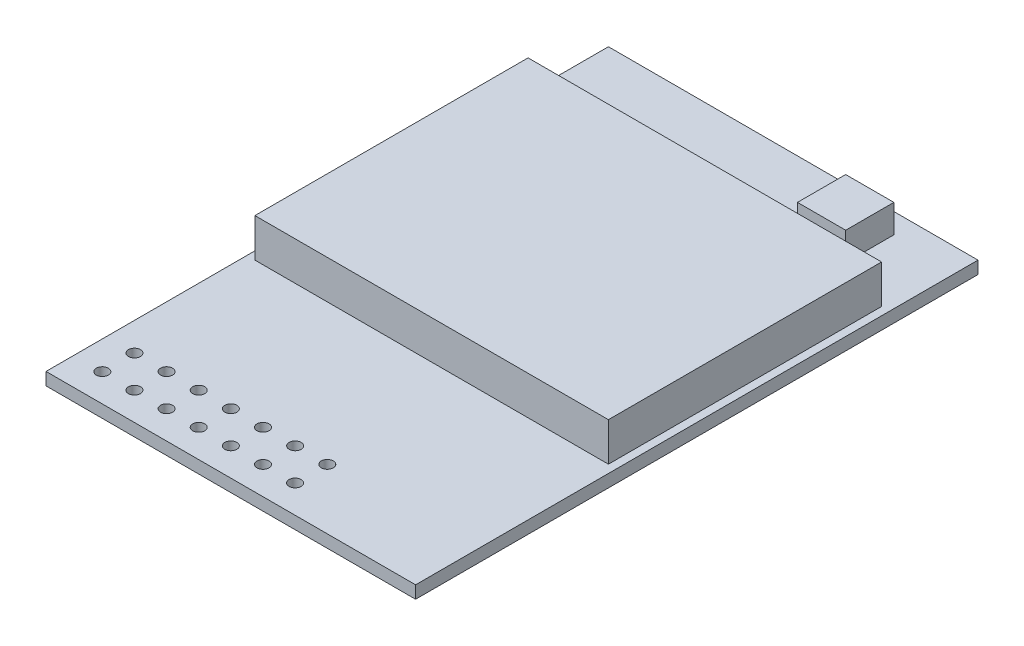
ISO-10303-21;
HEADER;
FILE_DESCRIPTION(('STEP AP214'),'2;1');
FILE_NAME('part.step','',(''),(''),'','','');
FILE_SCHEMA(('AUTOMOTIVE_DESIGN { 1 0 10303 214 1 1 1 1 }'));
ENDSEC;
DATA;
#1=APPLICATION_CONTEXT('core data for automotive mechanical design processes');
#2=APPLICATION_PROTOCOL_DEFINITION('international standard','automotive_design',2000,#1);
#3=PRODUCT_CONTEXT('',#1,'mechanical');
#4=PRODUCT('Part','Part','',(#3));
#5=PRODUCT_RELATED_PRODUCT_CATEGORY('part','',(#4));
#6=PRODUCT_DEFINITION_FORMATION('','',#4);
#7=PRODUCT_DEFINITION_CONTEXT('part definition',#1,'design');
#8=PRODUCT_DEFINITION('design','',#6,#7);
#9=PRODUCT_DEFINITION_SHAPE('','',#8);
#10=(LENGTH_UNIT() NAMED_UNIT(*) SI_UNIT(.MILLI.,.METRE.));
#11=(NAMED_UNIT(*) PLANE_ANGLE_UNIT() SI_UNIT($,.RADIAN.));
#12=(NAMED_UNIT(*) SI_UNIT($,.STERADIAN.) SOLID_ANGLE_UNIT());
#13=UNCERTAINTY_MEASURE_WITH_UNIT(LENGTH_MEASURE(1.E-05),#10,'distance_accuracy_value','');
#14=(GEOMETRIC_REPRESENTATION_CONTEXT(3) GLOBAL_UNCERTAINTY_ASSIGNED_CONTEXT((#13)) GLOBAL_UNIT_ASSIGNED_CONTEXT((#10,
#11,#12)) REPRESENTATION_CONTEXT('',''));
#15=CARTESIAN_POINT('',(0.,0.,0.));
#16=DIRECTION('',(0.,0.,1.));
#17=DIRECTION('',(1.,0.,0.));
#18=AXIS2_PLACEMENT_3D('',#15,#16,#17);
#19=CARTESIAN_POINT('',(0.,0.78,0.));
#20=DIRECTION('',(0.,-1.,0.));
#21=DIRECTION('',(0.,0.,-1.));
#22=AXIS2_PLACEMENT_3D('',#19,#20,#21);
#23=PLANE('',#22);
#24=CARTESIAN_POINT('',(-5.73693796657849,0.78,13.7591055458466));
#25=DIRECTION('',(0.,1.,0.));
#26=DIRECTION('',(0.,0.,1.));
#27=AXIS2_PLACEMENT_3D('',#24,#25,#26);
#28=CIRCLE('',#27,0.375000000000001);
#29=CARTESIAN_POINT('',(-5.73693796657849,0.78,14.1341055458466));
#30=VERTEX_POINT('',#29);
#31=EDGE_CURVE('E520',#30,#30,#28,.T.);
#32=ORIENTED_EDGE('',*,*,#31,.F.);
#33=EDGE_LOOP('',(#32));
#34=FACE_BOUND('',#33,.T.);
#35=CARTESIAN_POINT('',(-7.73693796657849,0.78,13.7591055458466));
#36=DIRECTION('',(0.,1.,0.));
#37=DIRECTION('',(0.,0.,1.));
#38=AXIS2_PLACEMENT_3D('',#35,#36,#37);
#39=CIRCLE('',#38,0.375000000000001);
#40=CARTESIAN_POINT('',(-7.73693796657849,0.78,14.1341055458466));
#41=VERTEX_POINT('',#40);
#42=EDGE_CURVE('E523',#41,#41,#39,.T.);
#43=ORIENTED_EDGE('',*,*,#42,.F.);
#44=EDGE_LOOP('',(#43));
#45=FACE_BOUND('',#44,.T.);
#46=CARTESIAN_POINT('',(2.26306203342152,0.78,15.7591055458466));
#47=DIRECTION('',(0.,1.,0.));
#48=DIRECTION('',(0.,0.,1.));
#49=AXIS2_PLACEMENT_3D('',#46,#47,#48);
#50=CIRCLE('',#49,0.375000000000001);
#51=CARTESIAN_POINT('',(2.26306203342152,0.78,16.1341055458466));
#52=VERTEX_POINT('',#51);
#53=EDGE_CURVE('E600',#52,#52,#50,.T.);
#54=ORIENTED_EDGE('',*,*,#53,.F.);
#55=EDGE_LOOP('',(#54));
#56=FACE_BOUND('',#55,.T.);
#57=CARTESIAN_POINT('',(0.263062033421519,0.78,15.7591055458466));
#58=DIRECTION('',(0.,1.,0.));
#59=DIRECTION('',(0.,0.,1.));
#60=AXIS2_PLACEMENT_3D('',#57,#58,#59);
#61=CIRCLE('',#60,0.375000000000001);
#62=CARTESIAN_POINT('',(0.263062033421519,0.78,16.1341055458466));
#63=VERTEX_POINT('',#62);
#64=EDGE_CURVE('E587',#63,#63,#61,.T.);
#65=ORIENTED_EDGE('',*,*,#64,.F.);
#66=EDGE_LOOP('',(#65));
#67=FACE_BOUND('',#66,.T.);
#68=CARTESIAN_POINT('',(-1.73693796657848,0.78,15.7591055458466));
#69=DIRECTION('',(0.,1.,0.));
#70=DIRECTION('',(0.,0.,1.));
#71=AXIS2_PLACEMENT_3D('',#68,#69,#70);
#72=CIRCLE('',#71,0.375000000000001);
#73=CARTESIAN_POINT('',(-1.73693796657848,0.78,16.1341055458466));
#74=VERTEX_POINT('',#73);
#75=EDGE_CURVE('E552',#74,#74,#72,.T.);
#76=ORIENTED_EDGE('',*,*,#75,.F.);
#77=EDGE_LOOP('',(#76));
#78=FACE_BOUND('',#77,.T.);
#79=CARTESIAN_POINT('',(-3.73693796657848,0.78,15.7591055458466));
#80=DIRECTION('',(0.,1.,0.));
#81=DIRECTION('',(0.,0.,1.));
#82=AXIS2_PLACEMENT_3D('',#79,#80,#81);
#83=CIRCLE('',#82,0.375000000000001);
#84=CARTESIAN_POINT('',(-3.73693796657848,0.78,16.1341055458466));
#85=VERTEX_POINT('',#84);
#86=EDGE_CURVE('E546',#85,#85,#83,.T.);
#87=ORIENTED_EDGE('',*,*,#86,.F.);
#88=EDGE_LOOP('',(#87));
#89=FACE_BOUND('',#88,.T.);
#90=CARTESIAN_POINT('',(-5.73693796657848,0.78,15.7591055458466));
#91=DIRECTION('',(0.,1.,0.));
#92=DIRECTION('',(0.,0.,1.));
#93=AXIS2_PLACEMENT_3D('',#90,#91,#92);
#94=CIRCLE('',#93,0.375000000000001);
#95=CARTESIAN_POINT('',(-5.73693796657848,0.78,16.1341055458466));
#96=VERTEX_POINT('',#95);
#97=EDGE_CURVE('E540',#96,#96,#94,.T.);
#98=ORIENTED_EDGE('',*,*,#97,.F.);
#99=EDGE_LOOP('',(#98));
#100=FACE_BOUND('',#99,.T.);
#101=CARTESIAN_POINT('',(-7.73693796657848,0.78,15.7591055458466));
#102=DIRECTION('',(0.,1.,0.));
#103=DIRECTION('',(0.,0.,1.));
#104=AXIS2_PLACEMENT_3D('',#101,#102,#103);
#105=CIRCLE('',#104,0.375000000000001);
#106=CARTESIAN_POINT('',(-7.73693796657848,0.78,16.1341055458466));
#107=VERTEX_POINT('',#106);
#108=EDGE_CURVE('E534',#107,#107,#105,.T.);
#109=ORIENTED_EDGE('',*,*,#108,.F.);
#110=EDGE_LOOP('',(#109));
#111=FACE_BOUND('',#110,.T.);
#112=CARTESIAN_POINT('',(-3.73693796657849,0.78,13.7591055458466));
#113=DIRECTION('',(0.,1.,0.));
#114=DIRECTION('',(0.,0.,1.));
#115=AXIS2_PLACEMENT_3D('',#112,#113,#114);
#116=CIRCLE('',#115,0.375000000000001);
#117=CARTESIAN_POINT('',(-3.73693796657849,0.78,14.1341055458466));
#118=VERTEX_POINT('',#117);
#119=EDGE_CURVE('E526',#118,#118,#116,.T.);
#120=ORIENTED_EDGE('',*,*,#119,.F.);
#121=EDGE_LOOP('',(#120));
#122=FACE_BOUND('',#121,.T.);
#123=CARTESIAN_POINT('',(-1.73693796657849,0.78,13.7591055458466));
#124=DIRECTION('',(0.,1.,0.));
#125=DIRECTION('',(0.,0.,1.));
#126=AXIS2_PLACEMENT_3D('',#123,#124,#125);
#127=CIRCLE('',#126,0.375000000000001);
#128=CARTESIAN_POINT('',(-1.73693796657849,0.78,14.1341055458466));
#129=VERTEX_POINT('',#128);
#130=EDGE_CURVE('E626',#129,#129,#127,.T.);
#131=ORIENTED_EDGE('',*,*,#130,.F.);
#132=EDGE_LOOP('',(#131));
#133=FACE_BOUND('',#132,.T.);
#134=CARTESIAN_POINT('',(0.263062033421512,0.78,13.7591055458466));
#135=DIRECTION('',(0.,1.,0.));
#136=DIRECTION('',(0.,0.,1.));
#137=AXIS2_PLACEMENT_3D('',#134,#135,#136);
#138=CIRCLE('',#137,0.375000000000001);
#139=CARTESIAN_POINT('',(0.263062033421512,0.78,14.1341055458466));
#140=VERTEX_POINT('',#139);
#141=EDGE_CURVE('E630',#140,#140,#138,.T.);
#142=ORIENTED_EDGE('',*,*,#141,.F.);
#143=EDGE_LOOP('',(#142));
#144=FACE_BOUND('',#143,.T.);
#145=CARTESIAN_POINT('',(2.26306203342151,0.78,13.7591055458466));
#146=DIRECTION('',(0.,1.,0.));
#147=DIRECTION('',(0.,0.,1.));
#148=AXIS2_PLACEMENT_3D('',#145,#146,#147);
#149=CIRCLE('',#148,0.375000000000001);
#150=CARTESIAN_POINT('',(2.26306203342151,0.78,14.1341055458466));
#151=VERTEX_POINT('',#150);
#152=EDGE_CURVE('E634',#151,#151,#149,.T.);
#153=ORIENTED_EDGE('',*,*,#152,.F.);
#154=EDGE_LOOP('',(#153));
#155=FACE_BOUND('',#154,.T.);
#156=CARTESIAN_POINT('',(-9.73693796657849,0.78,13.7591055458466));
#157=DIRECTION('',(0.,1.,0.));
#158=DIRECTION('',(0.,0.,1.));
#159=AXIS2_PLACEMENT_3D('',#156,#157,#158);
#160=CIRCLE('',#159,0.375000000000001);
#161=CARTESIAN_POINT('',(-9.73693796657849,0.78,14.1341055458466));
#162=VERTEX_POINT('',#161);
#163=EDGE_CURVE('E595',#162,#162,#160,.T.);
#164=ORIENTED_EDGE('',*,*,#163,.F.);
#165=EDGE_LOOP('',(#164));
#166=FACE_BOUND('',#165,.T.);
#167=CARTESIAN_POINT('',(-9.73693796657848,0.78,15.7591055458466));
#168=DIRECTION('',(0.,1.,0.));
#169=DIRECTION('',(0.,0.,1.));
#170=AXIS2_PLACEMENT_3D('',#167,#168,#169);
#171=CIRCLE('',#170,0.375000000000001);
#172=CARTESIAN_POINT('',(-9.73693796657848,0.78,16.1341055458466));
#173=VERTEX_POINT('',#172);
#174=EDGE_CURVE('E533',#173,#173,#171,.T.);
#175=ORIENTED_EDGE('',*,*,#174,.F.);
#176=EDGE_LOOP('',(#175));
#177=FACE_BOUND('',#176,.T.);
#178=DIRECTION('',(0.,0.,-1.));
#179=VECTOR('',#178,1.);
#180=CARTESIAN_POINT('',(11.,0.78,-12.));
#181=LINE('',#180,#179);
#182=CARTESIAN_POINT('',(11.,0.78,5.));
#183=VERTEX_POINT('',#182);
#184=CARTESIAN_POINT('',(11.,0.78,-12.));
#185=VERTEX_POINT('',#184);
#186=EDGE_CURVE('E149',#183,#185,#181,.T.);
#187=ORIENTED_EDGE('',*,*,#186,.F.);
#188=DIRECTION('',(1.,0.,0.));
#189=VECTOR('',#188,1.);
#190=CARTESIAN_POINT('',(-11.,0.78,5.));
#191=LINE('',#190,#189);
#192=CARTESIAN_POINT('',(-11.,0.78,5.));
#193=VERTEX_POINT('',#192);
#194=EDGE_CURVE('E162',#193,#183,#191,.T.);
#195=ORIENTED_EDGE('',*,*,#194,.F.);
#196=DIRECTION('',(0.,0.,1.));
#197=VECTOR('',#196,1.);
#198=CARTESIAN_POINT('',(-11.,0.78,-12.));
#199=LINE('',#198,#197);
#200=CARTESIAN_POINT('',(-11.,0.78,-12.));
#201=VERTEX_POINT('',#200);
#202=EDGE_CURVE('E171',#201,#193,#199,.T.);
#203=ORIENTED_EDGE('',*,*,#202,.F.);
#204=DIRECTION('',(-1.,0.,0.));
#205=VECTOR('',#204,1.);
#206=CARTESIAN_POINT('',(-11.,0.78,-12.));
#207=LINE('',#206,#205);
#208=EDGE_CURVE('E152',#185,#201,#207,.T.);
#209=ORIENTED_EDGE('',*,*,#208,.F.);
#210=EDGE_LOOP('',(#187,#195,#203,#209));
#211=FACE_BOUND('',#210,.T.);
#212=DIRECTION('',(0.,0.,-1.));
#213=VECTOR('',#212,1.);
#214=CARTESIAN_POINT('',(11.5,0.78,17.5));
#215=LINE('',#214,#213);
#216=CARTESIAN_POINT('',(11.5,0.78,17.5));
#217=VERTEX_POINT('',#216);
#218=CARTESIAN_POINT('',(11.5,0.78,-17.5));
#219=VERTEX_POINT('',#218);
#220=EDGE_CURVE('E188',#217,#219,#215,.T.);
#221=ORIENTED_EDGE('',*,*,#220,.T.);
#222=DIRECTION('',(-1.,0.,0.));
#223=VECTOR('',#222,1.);
#224=CARTESIAN_POINT('',(-11.5,0.78,-17.5));
#225=LINE('',#224,#223);
#226=CARTESIAN_POINT('',(-11.5,0.78,-17.5));
#227=VERTEX_POINT('',#226);
#228=EDGE_CURVE('E191',#219,#227,#225,.T.);
#229=ORIENTED_EDGE('',*,*,#228,.T.);
#230=DIRECTION('',(0.,0.,1.));
#231=VECTOR('',#230,1.);
#232=CARTESIAN_POINT('',(-11.5,0.78,17.5));
#233=LINE('',#232,#231);
#234=CARTESIAN_POINT('',(-11.5,0.78,17.5));
#235=VERTEX_POINT('',#234);
#236=EDGE_CURVE('E194',#227,#235,#233,.T.);
#237=ORIENTED_EDGE('',*,*,#236,.T.);
#238=DIRECTION('',(1.,0.,0.));
#239=VECTOR('',#238,1.);
#240=CARTESIAN_POINT('',(-11.5,0.78,17.5));
#241=LINE('',#240,#239);
#242=EDGE_CURVE('E196',#235,#217,#241,.T.);
#243=ORIENTED_EDGE('',*,*,#242,.T.);
#244=EDGE_LOOP('',(#221,#229,#237,#243));
#245=FACE_BOUND('',#244,.T.);
#246=DIRECTION('',(0.,0.,-1.));
#247=VECTOR('',#246,1.);
#248=CARTESIAN_POINT('',(7.52134132497843,0.78,-16.2441492984607));
#249=LINE('',#248,#247);
#250=CARTESIAN_POINT('',(7.52134132497843,0.78,-13.2441492984607));
#251=VERTEX_POINT('',#250);
#252=CARTESIAN_POINT('',(7.52134132497843,0.78,-16.2441492984607));
#253=VERTEX_POINT('',#252);
#254=EDGE_CURVE('E148',#251,#253,#249,.T.);
#255=ORIENTED_EDGE('',*,*,#254,.F.);
#256=DIRECTION('',(1.,0.,0.));
#257=VECTOR('',#256,1.);
#258=CARTESIAN_POINT('',(4.52134132497843,0.78,-13.2441492984607));
#259=LINE('',#258,#257);
#260=CARTESIAN_POINT('',(4.52134132497843,0.78,-13.2441492984607));
#261=VERTEX_POINT('',#260);
#262=EDGE_CURVE('E145',#261,#251,#259,.T.);
#263=ORIENTED_EDGE('',*,*,#262,.F.);
#264=DIRECTION('',(0.,0.,1.));
#265=VECTOR('',#264,1.);
#266=CARTESIAN_POINT('',(4.52134132497843,0.78,-16.2441492984607));
#267=LINE('',#266,#265);
#268=CARTESIAN_POINT('',(4.52134132497843,0.78,-16.2441492984607));
#269=VERTEX_POINT('',#268);
#270=EDGE_CURVE('E59',#269,#261,#267,.T.);
#271=ORIENTED_EDGE('',*,*,#270,.F.);
#272=DIRECTION('',(-1.,0.,0.));
#273=VECTOR('',#272,1.);
#274=CARTESIAN_POINT('',(4.52134132497843,0.78,-16.2441492984607));
#275=LINE('',#274,#273);
#276=EDGE_CURVE('E54',#253,#269,#275,.T.);
#277=ORIENTED_EDGE('',*,*,#276,.F.);
#278=EDGE_LOOP('',(#255,#263,#271,#277));
#279=FACE_BOUND('',#278,.T.);
#280=ADVANCED_FACE('F39',(#34,#45,#56,#67,#78,#89,#100,#111,#122,#133,#144,#155,#166,#177,#211,
#245,#279),#23,.F.);
#281=CARTESIAN_POINT('',(11.5,0.78,17.5));
#282=DIRECTION('',(-1.,0.,0.));
#283=DIRECTION('',(0.,0.,1.));
#284=AXIS2_PLACEMENT_3D('',#281,#282,#283);
#285=PLANE('',#284);
#286=DIRECTION('',(0.,0.,-1.));
#287=VECTOR('',#286,1.);
#288=CARTESIAN_POINT('',(11.5,0.,17.5));
#289=LINE('',#288,#287);
#290=CARTESIAN_POINT('',(11.5,0.,17.5));
#291=VERTEX_POINT('',#290);
#292=CARTESIAN_POINT('',(11.5,0.,-17.5));
#293=VERTEX_POINT('',#292);
#294=EDGE_CURVE('E187',#291,#293,#289,.T.);
#295=ORIENTED_EDGE('',*,*,#294,.T.);
#296=DIRECTION('',(0.,-1.,0.));
#297=VECTOR('',#296,1.);
#298=CARTESIAN_POINT('',(11.5,0.78,-17.5));
#299=LINE('',#298,#297);
#300=EDGE_CURVE('E11',#219,#293,#299,.T.);
#301=ORIENTED_EDGE('',*,*,#300,.F.);
#302=ORIENTED_EDGE('',*,*,#220,.F.);
#303=DIRECTION('',(0.,-1.,0.));
#304=VECTOR('',#303,1.);
#305=CARTESIAN_POINT('',(11.5,0.78,17.5));
#306=LINE('',#305,#304);
#307=EDGE_CURVE('E198',#217,#291,#306,.T.);
#308=ORIENTED_EDGE('',*,*,#307,.T.);
#309=EDGE_LOOP('',(#295,#301,#302,#308));
#310=FACE_BOUND('',#309,.T.);
#311=ADVANCED_FACE('F41',(#310),#285,.F.);
#312=CARTESIAN_POINT('',(-11.5,0.78,-17.5));
#313=DIRECTION('',(0.,0.,1.));
#314=DIRECTION('',(1.,0.,0.));
#315=AXIS2_PLACEMENT_3D('',#312,#313,#314);
#316=PLANE('',#315);
#317=DIRECTION('',(-1.,0.,0.));
#318=VECTOR('',#317,1.);
#319=CARTESIAN_POINT('',(-11.5,0.,-17.5));
#320=LINE('',#319,#318);
#321=CARTESIAN_POINT('',(-11.5,0.,-17.5));
#322=VERTEX_POINT('',#321);
#323=EDGE_CURVE('E201',#293,#322,#320,.T.);
#324=ORIENTED_EDGE('',*,*,#323,.T.);
#325=DIRECTION('',(0.,-1.,0.));
#326=VECTOR('',#325,1.);
#327=CARTESIAN_POINT('',(-11.5,0.78,-17.5));
#328=LINE('',#327,#326);
#329=EDGE_CURVE('E47',#227,#322,#328,.T.);
#330=ORIENTED_EDGE('',*,*,#329,.F.);
#331=ORIENTED_EDGE('',*,*,#228,.F.);
#332=ORIENTED_EDGE('',*,*,#300,.T.);
#333=EDGE_LOOP('',(#324,#330,#331,#332));
#334=FACE_BOUND('',#333,.T.);
#335=ADVANCED_FACE('F230',(#334),#316,.F.);
#336=CARTESIAN_POINT('',(-11.5,0.78,17.5));
#337=DIRECTION('',(1.,0.,0.));
#338=DIRECTION('',(0.,0.,-1.));
#339=AXIS2_PLACEMENT_3D('',#336,#337,#338);
#340=PLANE('',#339);
#341=DIRECTION('',(0.,0.,1.));
#342=VECTOR('',#341,1.);
#343=CARTESIAN_POINT('',(-11.5,0.,17.5));
#344=LINE('',#343,#342);
#345=CARTESIAN_POINT('',(-11.5,0.,17.5));
#346=VERTEX_POINT('',#345);
#347=EDGE_CURVE('E203',#322,#346,#344,.T.);
#348=ORIENTED_EDGE('',*,*,#347,.T.);
#349=DIRECTION('',(0.,-1.,0.));
#350=VECTOR('',#349,1.);
#351=CARTESIAN_POINT('',(-11.5,0.78,17.5));
#352=LINE('',#351,#350);
#353=EDGE_CURVE('E208',#235,#346,#352,.T.);
#354=ORIENTED_EDGE('',*,*,#353,.F.);
#355=ORIENTED_EDGE('',*,*,#236,.F.);
#356=ORIENTED_EDGE('',*,*,#329,.T.);
#357=EDGE_LOOP('',(#348,#354,#355,#356));
#358=FACE_BOUND('',#357,.T.);
#359=ADVANCED_FACE('F215',(#358),#340,.F.);
#360=CARTESIAN_POINT('',(-11.5,0.78,17.5));
#361=DIRECTION('',(0.,0.,-1.));
#362=DIRECTION('',(-1.,0.,0.));
#363=AXIS2_PLACEMENT_3D('',#360,#361,#362);
#364=PLANE('',#363);
#365=DIRECTION('',(1.,0.,0.));
#366=VECTOR('',#365,1.);
#367=CARTESIAN_POINT('',(-11.5,0.,17.5));
#368=LINE('',#367,#366);
#369=EDGE_CURVE('E192',#346,#291,#368,.T.);
#370=ORIENTED_EDGE('',*,*,#369,.T.);
#371=ORIENTED_EDGE('',*,*,#307,.F.);
#372=ORIENTED_EDGE('',*,*,#242,.F.);
#373=ORIENTED_EDGE('',*,*,#353,.T.);
#374=EDGE_LOOP('',(#370,#371,#372,#373));
#375=FACE_BOUND('',#374,.T.);
#376=ADVANCED_FACE('F224',(#375),#364,.F.);
#377=CARTESIAN_POINT('',(0.,0.,0.));
#378=DIRECTION('',(0.,-1.,0.));
#379=DIRECTION('',(0.,0.,-1.));
#380=AXIS2_PLACEMENT_3D('',#377,#378,#379);
#381=PLANE('',#380);
#382=CARTESIAN_POINT('',(-5.73693796657849,0.,13.7591055458466));
#383=DIRECTION('',(0.,1.,0.));
#384=DIRECTION('',(0.,0.,1.));
#385=AXIS2_PLACEMENT_3D('',#382,#383,#384);
#386=CIRCLE('',#385,0.375000000000001);
#387=CARTESIAN_POINT('',(-5.73693796657849,0.,14.1341055458466));
#388=VERTEX_POINT('',#387);
#389=EDGE_CURVE('E518',#388,#388,#386,.T.);
#390=ORIENTED_EDGE('',*,*,#389,.T.);
#391=EDGE_LOOP('',(#390));
#392=FACE_BOUND('',#391,.T.);
#393=CARTESIAN_POINT('',(-7.73693796657849,0.,13.7591055458466));
#394=DIRECTION('',(0.,1.,0.));
#395=DIRECTION('',(0.,0.,1.));
#396=AXIS2_PLACEMENT_3D('',#393,#394,#395);
#397=CIRCLE('',#396,0.375000000000001);
#398=CARTESIAN_POINT('',(-7.73693796657849,0.,14.1341055458466));
#399=VERTEX_POINT('',#398);
#400=EDGE_CURVE('E603',#399,#399,#397,.T.);
#401=ORIENTED_EDGE('',*,*,#400,.T.);
#402=EDGE_LOOP('',(#401));
#403=FACE_BOUND('',#402,.T.);
#404=CARTESIAN_POINT('',(2.26306203342152,0.,15.7591055458466));
#405=DIRECTION('',(0.,1.,0.));
#406=DIRECTION('',(0.,0.,1.));
#407=AXIS2_PLACEMENT_3D('',#404,#405,#406);
#408=CIRCLE('',#407,0.375000000000001);
#409=CARTESIAN_POINT('',(2.26306203342152,0.,16.1341055458466));
#410=VERTEX_POINT('',#409);
#411=EDGE_CURVE('E592',#410,#410,#408,.T.);
#412=ORIENTED_EDGE('',*,*,#411,.T.);
#413=EDGE_LOOP('',(#412));
#414=FACE_BOUND('',#413,.T.);
#415=CARTESIAN_POINT('',(0.263062033421519,0.,15.7591055458466));
#416=DIRECTION('',(0.,1.,0.));
#417=DIRECTION('',(0.,0.,1.));
#418=AXIS2_PLACEMENT_3D('',#415,#416,#417);
#419=CIRCLE('',#418,0.375000000000001);
#420=CARTESIAN_POINT('',(0.263062033421519,0.,16.1341055458466));
#421=VERTEX_POINT('',#420);
#422=EDGE_CURVE('E555',#421,#421,#419,.T.);
#423=ORIENTED_EDGE('',*,*,#422,.T.);
#424=EDGE_LOOP('',(#423));
#425=FACE_BOUND('',#424,.T.);
#426=CARTESIAN_POINT('',(-1.73693796657848,0.,15.7591055458466));
#427=DIRECTION('',(0.,1.,0.));
#428=DIRECTION('',(0.,0.,1.));
#429=AXIS2_PLACEMENT_3D('',#426,#427,#428);
#430=CIRCLE('',#429,0.375000000000001);
#431=CARTESIAN_POINT('',(-1.73693796657848,0.,16.1341055458466));
#432=VERTEX_POINT('',#431);
#433=EDGE_CURVE('E549',#432,#432,#430,.T.);
#434=ORIENTED_EDGE('',*,*,#433,.T.);
#435=EDGE_LOOP('',(#434));
#436=FACE_BOUND('',#435,.T.);
#437=CARTESIAN_POINT('',(-3.73693796657848,0.,15.7591055458466));
#438=DIRECTION('',(0.,1.,0.));
#439=DIRECTION('',(0.,0.,1.));
#440=AXIS2_PLACEMENT_3D('',#437,#438,#439);
#441=CIRCLE('',#440,0.375000000000001);
#442=CARTESIAN_POINT('',(-3.73693796657848,0.,16.1341055458466));
#443=VERTEX_POINT('',#442);
#444=EDGE_CURVE('E543',#443,#443,#441,.T.);
#445=ORIENTED_EDGE('',*,*,#444,.T.);
#446=EDGE_LOOP('',(#445));
#447=FACE_BOUND('',#446,.T.);
#448=CARTESIAN_POINT('',(-5.73693796657848,0.,15.7591055458466));
#449=DIRECTION('',(0.,1.,0.));
#450=DIRECTION('',(0.,0.,1.));
#451=AXIS2_PLACEMENT_3D('',#448,#449,#450);
#452=CIRCLE('',#451,0.375000000000001);
#453=CARTESIAN_POINT('',(-5.73693796657848,0.,16.1341055458466));
#454=VERTEX_POINT('',#453);
#455=EDGE_CURVE('E537',#454,#454,#452,.T.);
#456=ORIENTED_EDGE('',*,*,#455,.T.);
#457=EDGE_LOOP('',(#456));
#458=FACE_BOUND('',#457,.T.);
#459=CARTESIAN_POINT('',(-7.73693796657848,0.,15.7591055458466));
#460=DIRECTION('',(0.,1.,0.));
#461=DIRECTION('',(0.,0.,1.));
#462=AXIS2_PLACEMENT_3D('',#459,#460,#461);
#463=CIRCLE('',#462,0.375000000000001);
#464=CARTESIAN_POINT('',(-7.73693796657848,0.,16.1341055458466));
#465=VERTEX_POINT('',#464);
#466=EDGE_CURVE('E530',#465,#465,#463,.T.);
#467=ORIENTED_EDGE('',*,*,#466,.T.);
#468=EDGE_LOOP('',(#467));
#469=FACE_BOUND('',#468,.T.);
#470=CARTESIAN_POINT('',(-3.73693796657849,0.,13.7591055458466));
#471=DIRECTION('',(0.,1.,0.));
#472=DIRECTION('',(0.,0.,1.));
#473=AXIS2_PLACEMENT_3D('',#470,#471,#472);
#474=CIRCLE('',#473,0.375000000000001);
#475=CARTESIAN_POINT('',(-3.73693796657849,0.,14.1341055458466));
#476=VERTEX_POINT('',#475);
#477=EDGE_CURVE('E521',#476,#476,#474,.T.);
#478=ORIENTED_EDGE('',*,*,#477,.T.);
#479=EDGE_LOOP('',(#478));
#480=FACE_BOUND('',#479,.T.);
#481=CARTESIAN_POINT('',(-1.73693796657849,0.,13.7591055458466));
#482=DIRECTION('',(0.,1.,0.));
#483=DIRECTION('',(0.,0.,1.));
#484=AXIS2_PLACEMENT_3D('',#481,#482,#483);
#485=CIRCLE('',#484,0.375000000000001);
#486=CARTESIAN_POINT('',(-1.73693796657849,0.,14.1341055458466));
#487=VERTEX_POINT('',#486);
#488=EDGE_CURVE('E652',#487,#487,#485,.T.);
#489=ORIENTED_EDGE('',*,*,#488,.T.);
#490=EDGE_LOOP('',(#489));
#491=FACE_BOUND('',#490,.T.);
#492=CARTESIAN_POINT('',(0.263062033421512,0.,13.7591055458466));
#493=DIRECTION('',(0.,1.,0.));
#494=DIRECTION('',(0.,0.,1.));
#495=AXIS2_PLACEMENT_3D('',#492,#493,#494);
#496=CIRCLE('',#495,0.375000000000001);
#497=CARTESIAN_POINT('',(0.263062033421512,0.,14.1341055458466));
#498=VERTEX_POINT('',#497);
#499=EDGE_CURVE('E648',#498,#498,#496,.T.);
#500=ORIENTED_EDGE('',*,*,#499,.T.);
#501=EDGE_LOOP('',(#500));
#502=FACE_BOUND('',#501,.T.);
#503=CARTESIAN_POINT('',(2.26306203342151,0.,13.7591055458466));
#504=DIRECTION('',(0.,1.,0.));
#505=DIRECTION('',(0.,0.,1.));
#506=AXIS2_PLACEMENT_3D('',#503,#504,#505);
#507=CIRCLE('',#506,0.375000000000001);
#508=CARTESIAN_POINT('',(2.26306203342151,0.,14.1341055458466));
#509=VERTEX_POINT('',#508);
#510=EDGE_CURVE('E642',#509,#509,#507,.T.);
#511=ORIENTED_EDGE('',*,*,#510,.T.);
#512=EDGE_LOOP('',(#511));
#513=FACE_BOUND('',#512,.T.);
#514=CARTESIAN_POINT('',(-9.73693796657849,0.,13.7591055458466));
#515=DIRECTION('',(0.,1.,0.));
#516=DIRECTION('',(0.,0.,1.));
#517=AXIS2_PLACEMENT_3D('',#514,#515,#516);
#518=CIRCLE('',#517,0.375000000000001);
#519=CARTESIAN_POINT('',(-9.73693796657849,0.,14.1341055458466));
#520=VERTEX_POINT('',#519);
#521=EDGE_CURVE('E638',#520,#520,#518,.T.);
#522=ORIENTED_EDGE('',*,*,#521,.T.);
#523=EDGE_LOOP('',(#522));
#524=FACE_BOUND('',#523,.T.);
#525=CARTESIAN_POINT('',(-9.73693796657848,0.,15.7591055458466));
#526=DIRECTION('',(0.,1.,0.));
#527=DIRECTION('',(0.,0.,1.));
#528=AXIS2_PLACEMENT_3D('',#525,#526,#527);
#529=CIRCLE('',#528,0.375000000000001);
#530=CARTESIAN_POINT('',(-9.73693796657848,0.,16.1341055458466));
#531=VERTEX_POINT('',#530);
#532=EDGE_CURVE('E556',#531,#531,#529,.T.);
#533=ORIENTED_EDGE('',*,*,#532,.T.);
#534=EDGE_LOOP('',(#533));
#535=FACE_BOUND('',#534,.T.);
#536=ORIENTED_EDGE('',*,*,#294,.F.);
#537=ORIENTED_EDGE('',*,*,#369,.F.);
#538=ORIENTED_EDGE('',*,*,#347,.F.);
#539=ORIENTED_EDGE('',*,*,#323,.F.);
#540=EDGE_LOOP('',(#536,#537,#538,#539));
#541=FACE_BOUND('',#540,.T.);
#542=ADVANCED_FACE('F221',(#392,#403,#414,#425,#436,#447,#458,#469,#480,#491,#502,#513,#524,
#535,#541),#381,.T.);
#543=CARTESIAN_POINT('',(11.,3.18,-12.));
#544=DIRECTION('',(-1.,0.,0.));
#545=DIRECTION('',(0.,0.,1.));
#546=AXIS2_PLACEMENT_3D('',#543,#544,#545);
#547=PLANE('',#546);
#548=ORIENTED_EDGE('',*,*,#186,.T.);
#549=DIRECTION('',(0.,-1.,0.));
#550=VECTOR('',#549,1.);
#551=CARTESIAN_POINT('',(11.,3.18,-12.));
#552=LINE('',#551,#550);
#553=CARTESIAN_POINT('',(11.,3.18,-12.));
#554=VERTEX_POINT('',#553);
#555=EDGE_CURVE('E184',#554,#185,#552,.T.);
#556=ORIENTED_EDGE('',*,*,#555,.F.);
#557=DIRECTION('',(0.,0.,-1.));
#558=VECTOR('',#557,1.);
#559=CARTESIAN_POINT('',(11.,3.18,-12.));
#560=LINE('',#559,#558);
#561=CARTESIAN_POINT('',(11.,3.18,5.));
#562=VERTEX_POINT('',#561);
#563=EDGE_CURVE('E158',#562,#554,#560,.T.);
#564=ORIENTED_EDGE('',*,*,#563,.F.);
#565=DIRECTION('',(0.,-1.,0.));
#566=VECTOR('',#565,1.);
#567=CARTESIAN_POINT('',(11.,3.18,5.));
#568=LINE('',#567,#566);
#569=EDGE_CURVE('E167',#562,#183,#568,.T.);
#570=ORIENTED_EDGE('',*,*,#569,.T.);
#571=EDGE_LOOP('',(#548,#556,#564,#570));
#572=FACE_BOUND('',#571,.T.);
#573=ADVANCED_FACE('F246',(#572),#547,.F.);
#574=CARTESIAN_POINT('',(-11.,3.18,-12.));
#575=DIRECTION('',(0.,0.,1.));
#576=DIRECTION('',(1.,0.,0.));
#577=AXIS2_PLACEMENT_3D('',#574,#575,#576);
#578=PLANE('',#577);
#579=ORIENTED_EDGE('',*,*,#208,.T.);
#580=DIRECTION('',(0.,-1.,0.));
#581=VECTOR('',#580,1.);
#582=CARTESIAN_POINT('',(-11.,3.18,-12.));
#583=LINE('',#582,#581);
#584=CARTESIAN_POINT('',(-11.,3.18,-12.));
#585=VERTEX_POINT('',#584);
#586=EDGE_CURVE('E181',#585,#201,#583,.T.);
#587=ORIENTED_EDGE('',*,*,#586,.F.);
#588=DIRECTION('',(-1.,0.,0.));
#589=VECTOR('',#588,1.);
#590=CARTESIAN_POINT('',(-11.,3.18,-12.));
#591=LINE('',#590,#589);
#592=EDGE_CURVE('E161',#554,#585,#591,.T.);
#593=ORIENTED_EDGE('',*,*,#592,.F.);
#594=ORIENTED_EDGE('',*,*,#555,.T.);
#595=EDGE_LOOP('',(#579,#587,#593,#594));
#596=FACE_BOUND('',#595,.T.);
#597=ADVANCED_FACE('F267',(#596),#578,.F.);
#598=CARTESIAN_POINT('',(-11.,3.18,-12.));
#599=DIRECTION('',(1.,0.,0.));
#600=DIRECTION('',(0.,0.,-1.));
#601=AXIS2_PLACEMENT_3D('',#598,#599,#600);
#602=PLANE('',#601);
#603=ORIENTED_EDGE('',*,*,#202,.T.);
#604=DIRECTION('',(0.,-1.,0.));
#605=VECTOR('',#604,1.);
#606=CARTESIAN_POINT('',(-11.,3.18,5.));
#607=LINE('',#606,#605);
#608=CARTESIAN_POINT('',(-11.,3.18,5.));
#609=VERTEX_POINT('',#608);
#610=EDGE_CURVE('E178',#609,#193,#607,.T.);
#611=ORIENTED_EDGE('',*,*,#610,.F.);
#612=DIRECTION('',(0.,0.,1.));
#613=VECTOR('',#612,1.);
#614=CARTESIAN_POINT('',(-11.,3.18,-12.));
#615=LINE('',#614,#613);
#616=EDGE_CURVE('E164',#585,#609,#615,.T.);
#617=ORIENTED_EDGE('',*,*,#616,.F.);
#618=ORIENTED_EDGE('',*,*,#586,.T.);
#619=EDGE_LOOP('',(#603,#611,#617,#618));
#620=FACE_BOUND('',#619,.T.);
#621=ADVANCED_FACE('F274',(#620),#602,.F.);
#622=CARTESIAN_POINT('',(-11.,3.18,5.));
#623=DIRECTION('',(0.,0.,-1.));
#624=DIRECTION('',(-1.,0.,0.));
#625=AXIS2_PLACEMENT_3D('',#622,#623,#624);
#626=PLANE('',#625);
#627=ORIENTED_EDGE('',*,*,#194,.T.);
#628=ORIENTED_EDGE('',*,*,#569,.F.);
#629=DIRECTION('',(1.,0.,0.));
#630=VECTOR('',#629,1.);
#631=CARTESIAN_POINT('',(-11.,3.18,5.));
#632=LINE('',#631,#630);
#633=EDGE_CURVE('E166',#609,#562,#632,.T.);
#634=ORIENTED_EDGE('',*,*,#633,.F.);
#635=ORIENTED_EDGE('',*,*,#610,.T.);
#636=EDGE_LOOP('',(#627,#628,#634,#635));
#637=FACE_BOUND('',#636,.T.);
#638=ADVANCED_FACE('F281',(#637),#626,.F.);
#639=CARTESIAN_POINT('',(0.,3.18,0.));
#640=DIRECTION('',(0.,1.,0.));
#641=DIRECTION('',(0.,0.,1.));
#642=AXIS2_PLACEMENT_3D('',#639,#640,#641);
#643=PLANE('',#642);
#644=ORIENTED_EDGE('',*,*,#563,.T.);
#645=ORIENTED_EDGE('',*,*,#592,.T.);
#646=ORIENTED_EDGE('',*,*,#616,.T.);
#647=ORIENTED_EDGE('',*,*,#633,.T.);
#648=EDGE_LOOP('',(#644,#645,#646,#647));
#649=FACE_BOUND('',#648,.T.);
#650=ADVANCED_FACE('F289',(#649),#643,.T.);
#651=CARTESIAN_POINT('',(7.52134132497843,2.53,-16.2441492984607));
#652=DIRECTION('',(-1.,0.,0.));
#653=DIRECTION('',(0.,0.,1.));
#654=AXIS2_PLACEMENT_3D('',#651,#652,#653);
#655=PLANE('',#654);
#656=ORIENTED_EDGE('',*,*,#254,.T.);
#657=DIRECTION('',(0.,-1.,0.));
#658=VECTOR('',#657,1.);
#659=CARTESIAN_POINT('',(7.52134132497843,2.53,-16.2441492984607));
#660=LINE('',#659,#658);
#661=CARTESIAN_POINT('',(7.52134132497843,2.53,-16.2441492984607));
#662=VERTEX_POINT('',#661);
#663=EDGE_CURVE('E129',#662,#253,#660,.T.);
#664=ORIENTED_EDGE('',*,*,#663,.F.);
#665=DIRECTION('',(0.,0.,-1.));
#666=VECTOR('',#665,1.);
#667=CARTESIAN_POINT('',(7.52134132497843,2.53,-16.2441492984607));
#668=LINE('',#667,#666);
#669=CARTESIAN_POINT('',(7.52134132497843,2.53,-13.2441492984607));
#670=VERTEX_POINT('',#669);
#671=EDGE_CURVE('E136',#670,#662,#668,.T.);
#672=ORIENTED_EDGE('',*,*,#671,.F.);
#673=DIRECTION('',(0.,-1.,0.));
#674=VECTOR('',#673,1.);
#675=CARTESIAN_POINT('',(7.52134132497843,2.53,-13.2441492984607));
#676=LINE('',#675,#674);
#677=EDGE_CURVE('E563',#670,#251,#676,.T.);
#678=ORIENTED_EDGE('',*,*,#677,.T.);
#679=EDGE_LOOP('',(#656,#664,#672,#678));
#680=FACE_BOUND('',#679,.T.);
#681=ADVANCED_FACE('F147',(#680),#655,.F.);
#682=CARTESIAN_POINT('',(4.52134132497843,2.53,-16.2441492984607));
#683=DIRECTION('',(0.,0.,1.));
#684=DIRECTION('',(1.,0.,0.));
#685=AXIS2_PLACEMENT_3D('',#682,#683,#684);
#686=PLANE('',#685);
#687=ORIENTED_EDGE('',*,*,#276,.T.);
#688=DIRECTION('',(0.,-1.,0.));
#689=VECTOR('',#688,1.);
#690=CARTESIAN_POINT('',(4.52134132497843,2.53,-16.2441492984607));
#691=LINE('',#690,#689);
#692=CARTESIAN_POINT('',(4.52134132497843,2.53,-16.2441492984607));
#693=VERTEX_POINT('',#692);
#694=EDGE_CURVE('E132',#693,#269,#691,.T.);
#695=ORIENTED_EDGE('',*,*,#694,.F.);
#696=DIRECTION('',(-1.,0.,0.));
#697=VECTOR('',#696,1.);
#698=CARTESIAN_POINT('',(4.52134132497843,2.53,-16.2441492984607));
#699=LINE('',#698,#697);
#700=EDGE_CURVE('E125',#662,#693,#699,.T.);
#701=ORIENTED_EDGE('',*,*,#700,.F.);
#702=ORIENTED_EDGE('',*,*,#663,.T.);
#703=EDGE_LOOP('',(#687,#695,#701,#702));
#704=FACE_BOUND('',#703,.T.);
#705=ADVANCED_FACE('F127',(#704),#686,.F.);
#706=CARTESIAN_POINT('',(4.52134132497843,2.53,-16.2441492984607));
#707=DIRECTION('',(1.,0.,0.));
#708=DIRECTION('',(0.,0.,-1.));
#709=AXIS2_PLACEMENT_3D('',#706,#707,#708);
#710=PLANE('',#709);
#711=ORIENTED_EDGE('',*,*,#270,.T.);
#712=DIRECTION('',(0.,-1.,0.));
#713=VECTOR('',#712,1.);
#714=CARTESIAN_POINT('',(4.52134132497843,2.53,-13.2441492984607));
#715=LINE('',#714,#713);
#716=CARTESIAN_POINT('',(4.52134132497843,2.53,-13.2441492984607));
#717=VERTEX_POINT('',#716);
#718=EDGE_CURVE('E154',#717,#261,#715,.T.);
#719=ORIENTED_EDGE('',*,*,#718,.F.);
#720=DIRECTION('',(0.,0.,1.));
#721=VECTOR('',#720,1.);
#722=CARTESIAN_POINT('',(4.52134132497843,2.53,-16.2441492984607));
#723=LINE('',#722,#721);
#724=EDGE_CURVE('E135',#693,#717,#723,.T.);
#725=ORIENTED_EDGE('',*,*,#724,.F.);
#726=ORIENTED_EDGE('',*,*,#694,.T.);
#727=EDGE_LOOP('',(#711,#719,#725,#726));
#728=FACE_BOUND('',#727,.T.);
#729=ADVANCED_FACE('F310',(#728),#710,.F.);
#730=CARTESIAN_POINT('',(4.52134132497843,2.53,-13.2441492984607));
#731=DIRECTION('',(0.,0.,-1.));
#732=DIRECTION('',(-1.,0.,0.));
#733=AXIS2_PLACEMENT_3D('',#730,#731,#732);
#734=PLANE('',#733);
#735=ORIENTED_EDGE('',*,*,#262,.T.);
#736=ORIENTED_EDGE('',*,*,#677,.F.);
#737=DIRECTION('',(1.,0.,0.));
#738=VECTOR('',#737,1.);
#739=CARTESIAN_POINT('',(4.52134132497843,2.53,-13.2441492984607));
#740=LINE('',#739,#738);
#741=EDGE_CURVE('E141',#717,#670,#740,.T.);
#742=ORIENTED_EDGE('',*,*,#741,.F.);
#743=ORIENTED_EDGE('',*,*,#718,.T.);
#744=EDGE_LOOP('',(#735,#736,#742,#743));
#745=FACE_BOUND('',#744,.T.);
#746=ADVANCED_FACE('F317',(#745),#734,.F.);
#747=CARTESIAN_POINT('',(0.,2.53,0.));
#748=DIRECTION('',(0.,1.,0.));
#749=DIRECTION('',(0.,0.,1.));
#750=AXIS2_PLACEMENT_3D('',#747,#748,#749);
#751=PLANE('',#750);
#752=ORIENTED_EDGE('',*,*,#671,.T.);
#753=ORIENTED_EDGE('',*,*,#700,.T.);
#754=ORIENTED_EDGE('',*,*,#724,.T.);
#755=ORIENTED_EDGE('',*,*,#741,.T.);
#756=EDGE_LOOP('',(#752,#753,#754,#755));
#757=FACE_BOUND('',#756,.T.);
#758=ADVANCED_FACE('F139',(#757),#751,.T.);
#759=CARTESIAN_POINT('',(-9.73693796657848,0.,15.7591055458466));
#760=DIRECTION('',(0.,1.,0.));
#761=DIRECTION('',(0.,0.,1.));
#762=AXIS2_PLACEMENT_3D('',#759,#760,#761);
#763=CYLINDRICAL_SURFACE('',#762,0.375000000000001);
#764=ORIENTED_EDGE('',*,*,#532,.F.);
#765=EDGE_LOOP('',(#764));
#766=FACE_BOUND('',#765,.T.);
#767=ORIENTED_EDGE('',*,*,#174,.T.);
#768=EDGE_LOOP('',(#767));
#769=FACE_BOUND('',#768,.T.);
#770=ADVANCED_FACE('F332',(#766,#769),#763,.F.);
#771=CARTESIAN_POINT('',(-9.73693796657849,0.,13.7591055458466));
#772=DIRECTION('',(0.,1.,0.));
#773=DIRECTION('',(0.,0.,1.));
#774=AXIS2_PLACEMENT_3D('',#771,#772,#773);
#775=CYLINDRICAL_SURFACE('',#774,0.375000000000001);
#776=ORIENTED_EDGE('',*,*,#521,.F.);
#777=EDGE_LOOP('',(#776));
#778=FACE_BOUND('',#777,.T.);
#779=ORIENTED_EDGE('',*,*,#163,.T.);
#780=EDGE_LOOP('',(#779));
#781=FACE_BOUND('',#780,.T.);
#782=ADVANCED_FACE('F338',(#778,#781),#775,.F.);
#783=CARTESIAN_POINT('',(2.26306203342151,0.,13.7591055458466));
#784=DIRECTION('',(0.,1.,0.));
#785=DIRECTION('',(0.,0.,1.));
#786=AXIS2_PLACEMENT_3D('',#783,#784,#785);
#787=CYLINDRICAL_SURFACE('',#786,0.375000000000001);
#788=ORIENTED_EDGE('',*,*,#510,.F.);
#789=EDGE_LOOP('',(#788));
#790=FACE_BOUND('',#789,.T.);
#791=ORIENTED_EDGE('',*,*,#152,.T.);
#792=EDGE_LOOP('',(#791));
#793=FACE_BOUND('',#792,.T.);
#794=ADVANCED_FACE('F346',(#790,#793),#787,.F.);
#795=CARTESIAN_POINT('',(0.263062033421512,0.,13.7591055458466));
#796=DIRECTION('',(0.,1.,0.));
#797=DIRECTION('',(0.,0.,1.));
#798=AXIS2_PLACEMENT_3D('',#795,#796,#797);
#799=CYLINDRICAL_SURFACE('',#798,0.375000000000001);
#800=ORIENTED_EDGE('',*,*,#499,.F.);
#801=EDGE_LOOP('',(#800));
#802=FACE_BOUND('',#801,.T.);
#803=ORIENTED_EDGE('',*,*,#141,.T.);
#804=EDGE_LOOP('',(#803));
#805=FACE_BOUND('',#804,.T.);
#806=ADVANCED_FACE('F354',(#802,#805),#799,.F.);
#807=CARTESIAN_POINT('',(-1.73693796657849,0.,13.7591055458466));
#808=DIRECTION('',(0.,1.,0.));
#809=DIRECTION('',(0.,0.,1.));
#810=AXIS2_PLACEMENT_3D('',#807,#808,#809);
#811=CYLINDRICAL_SURFACE('',#810,0.375000000000001);
#812=ORIENTED_EDGE('',*,*,#488,.F.);
#813=EDGE_LOOP('',(#812));
#814=FACE_BOUND('',#813,.T.);
#815=ORIENTED_EDGE('',*,*,#130,.T.);
#816=EDGE_LOOP('',(#815));
#817=FACE_BOUND('',#816,.T.);
#818=ADVANCED_FACE('F362',(#814,#817),#811,.F.);
#819=CARTESIAN_POINT('',(-3.73693796657849,0.,13.7591055458466));
#820=DIRECTION('',(0.,1.,0.));
#821=DIRECTION('',(0.,0.,1.));
#822=AXIS2_PLACEMENT_3D('',#819,#820,#821);
#823=CYLINDRICAL_SURFACE('',#822,0.375000000000001);
#824=ORIENTED_EDGE('',*,*,#477,.F.);
#825=EDGE_LOOP('',(#824));
#826=FACE_BOUND('',#825,.T.);
#827=ORIENTED_EDGE('',*,*,#119,.T.);
#828=EDGE_LOOP('',(#827));
#829=FACE_BOUND('',#828,.T.);
#830=ADVANCED_FACE('F370',(#826,#829),#823,.F.);
#831=CARTESIAN_POINT('',(-7.73693796657848,0.,15.7591055458466));
#832=DIRECTION('',(0.,1.,0.));
#833=DIRECTION('',(0.,0.,1.));
#834=AXIS2_PLACEMENT_3D('',#831,#832,#833);
#835=CYLINDRICAL_SURFACE('',#834,0.375000000000001);
#836=ORIENTED_EDGE('',*,*,#466,.F.);
#837=EDGE_LOOP('',(#836));
#838=FACE_BOUND('',#837,.T.);
#839=ORIENTED_EDGE('',*,*,#108,.T.);
#840=EDGE_LOOP('',(#839));
#841=FACE_BOUND('',#840,.T.);
#842=ADVANCED_FACE('F378',(#838,#841),#835,.F.);
#843=CARTESIAN_POINT('',(-5.73693796657848,0.,15.7591055458466));
#844=DIRECTION('',(0.,1.,0.));
#845=DIRECTION('',(0.,0.,1.));
#846=AXIS2_PLACEMENT_3D('',#843,#844,#845);
#847=CYLINDRICAL_SURFACE('',#846,0.375000000000001);
#848=ORIENTED_EDGE('',*,*,#455,.F.);
#849=EDGE_LOOP('',(#848));
#850=FACE_BOUND('',#849,.T.);
#851=ORIENTED_EDGE('',*,*,#97,.T.);
#852=EDGE_LOOP('',(#851));
#853=FACE_BOUND('',#852,.T.);
#854=ADVANCED_FACE('F386',(#850,#853),#847,.F.);
#855=CARTESIAN_POINT('',(-3.73693796657848,0.,15.7591055458466));
#856=DIRECTION('',(0.,1.,0.));
#857=DIRECTION('',(0.,0.,1.));
#858=AXIS2_PLACEMENT_3D('',#855,#856,#857);
#859=CYLINDRICAL_SURFACE('',#858,0.375000000000001);
#860=ORIENTED_EDGE('',*,*,#444,.F.);
#861=EDGE_LOOP('',(#860));
#862=FACE_BOUND('',#861,.T.);
#863=ORIENTED_EDGE('',*,*,#86,.T.);
#864=EDGE_LOOP('',(#863));
#865=FACE_BOUND('',#864,.T.);
#866=ADVANCED_FACE('F394',(#862,#865),#859,.F.);
#867=CARTESIAN_POINT('',(-1.73693796657848,0.,15.7591055458466));
#868=DIRECTION('',(0.,1.,0.));
#869=DIRECTION('',(0.,0.,1.));
#870=AXIS2_PLACEMENT_3D('',#867,#868,#869);
#871=CYLINDRICAL_SURFACE('',#870,0.375000000000001);
#872=ORIENTED_EDGE('',*,*,#433,.F.);
#873=EDGE_LOOP('',(#872));
#874=FACE_BOUND('',#873,.T.);
#875=ORIENTED_EDGE('',*,*,#75,.T.);
#876=EDGE_LOOP('',(#875));
#877=FACE_BOUND('',#876,.T.);
#878=ADVANCED_FACE('F402',(#874,#877),#871,.F.);
#879=CARTESIAN_POINT('',(0.263062033421519,0.,15.7591055458466));
#880=DIRECTION('',(0.,1.,0.));
#881=DIRECTION('',(0.,0.,1.));
#882=AXIS2_PLACEMENT_3D('',#879,#880,#881);
#883=CYLINDRICAL_SURFACE('',#882,0.375000000000001);
#884=ORIENTED_EDGE('',*,*,#422,.F.);
#885=EDGE_LOOP('',(#884));
#886=FACE_BOUND('',#885,.T.);
#887=ORIENTED_EDGE('',*,*,#64,.T.);
#888=EDGE_LOOP('',(#887));
#889=FACE_BOUND('',#888,.T.);
#890=ADVANCED_FACE('F410',(#886,#889),#883,.F.);
#891=CARTESIAN_POINT('',(2.26306203342152,0.,15.7591055458466));
#892=DIRECTION('',(0.,1.,0.));
#893=DIRECTION('',(0.,0.,1.));
#894=AXIS2_PLACEMENT_3D('',#891,#892,#893);
#895=CYLINDRICAL_SURFACE('',#894,0.375000000000001);
#896=ORIENTED_EDGE('',*,*,#411,.F.);
#897=EDGE_LOOP('',(#896));
#898=FACE_BOUND('',#897,.T.);
#899=ORIENTED_EDGE('',*,*,#53,.T.);
#900=EDGE_LOOP('',(#899));
#901=FACE_BOUND('',#900,.T.);
#902=ADVANCED_FACE('F418',(#898,#901),#895,.F.);
#903=CARTESIAN_POINT('',(-7.73693796657849,0.,13.7591055458466));
#904=DIRECTION('',(0.,1.,0.));
#905=DIRECTION('',(0.,0.,1.));
#906=AXIS2_PLACEMENT_3D('',#903,#904,#905);
#907=CYLINDRICAL_SURFACE('',#906,0.375000000000001);
#908=ORIENTED_EDGE('',*,*,#400,.F.);
#909=EDGE_LOOP('',(#908));
#910=FACE_BOUND('',#909,.T.);
#911=ORIENTED_EDGE('',*,*,#42,.T.);
#912=EDGE_LOOP('',(#911));
#913=FACE_BOUND('',#912,.T.);
#914=ADVANCED_FACE('F426',(#910,#913),#907,.F.);
#915=CARTESIAN_POINT('',(-5.73693796657849,0.,13.7591055458466));
#916=DIRECTION('',(0.,1.,0.));
#917=DIRECTION('',(0.,0.,1.));
#918=AXIS2_PLACEMENT_3D('',#915,#916,#917);
#919=CYLINDRICAL_SURFACE('',#918,0.375000000000001);
#920=ORIENTED_EDGE('',*,*,#389,.F.);
#921=EDGE_LOOP('',(#920));
#922=FACE_BOUND('',#921,.T.);
#923=ORIENTED_EDGE('',*,*,#31,.T.);
#924=EDGE_LOOP('',(#923));
#925=FACE_BOUND('',#924,.T.);
#926=ADVANCED_FACE('F434',(#922,#925),#919,.F.);
#927=CLOSED_SHELL('',(#280,#311,#335,#359,#376,#542,#573,#597,#621,#638,#650,#681,#705,#729,
#746,#758,#770,#782,#794,#806,#818,#830,#842,#854,#866,#878,#890,#902,#914,#926));
#928=MANIFOLD_SOLID_BREP('B2',#927);
#929=ADVANCED_BREP_SHAPE_REPRESENTATION('',(#18,#928),#14);
#930=SHAPE_DEFINITION_REPRESENTATION(#9,#929);
ENDSEC;
END-ISO-10303-21;
